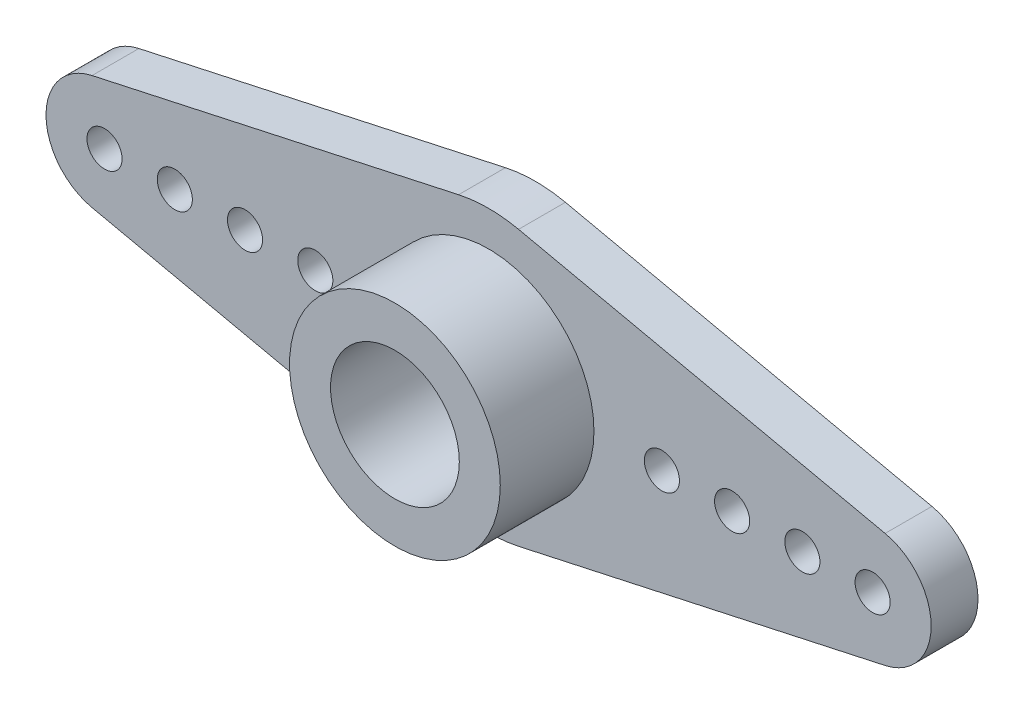
ISO-10303-21;
HEADER;
FILE_DESCRIPTION(('STEP AP214'),'2;1');
FILE_NAME('part.step','',(''),(''),'','','');
FILE_SCHEMA(('AUTOMOTIVE_DESIGN { 1 0 10303 214 1 1 1 1 }'));
ENDSEC;
DATA;
#1=APPLICATION_CONTEXT('core data for automotive mechanical design processes');
#2=APPLICATION_PROTOCOL_DEFINITION('international standard','automotive_design',2000,#1);
#3=PRODUCT_CONTEXT('',#1,'mechanical');
#4=PRODUCT('Part','Part','',(#3));
#5=PRODUCT_RELATED_PRODUCT_CATEGORY('part','',(#4));
#6=PRODUCT_DEFINITION_FORMATION('','',#4);
#7=PRODUCT_DEFINITION_CONTEXT('part definition',#1,'design');
#8=PRODUCT_DEFINITION('design','',#6,#7);
#9=PRODUCT_DEFINITION_SHAPE('','',#8);
#10=(LENGTH_UNIT() NAMED_UNIT(*) SI_UNIT(.MILLI.,.METRE.));
#11=(NAMED_UNIT(*) PLANE_ANGLE_UNIT() SI_UNIT($,.RADIAN.));
#12=(NAMED_UNIT(*) SI_UNIT($,.STERADIAN.) SOLID_ANGLE_UNIT());
#13=UNCERTAINTY_MEASURE_WITH_UNIT(LENGTH_MEASURE(1.E-05),#10,'distance_accuracy_value','');
#14=(GEOMETRIC_REPRESENTATION_CONTEXT(3) GLOBAL_UNCERTAINTY_ASSIGNED_CONTEXT((#13)) GLOBAL_UNIT_ASSIGNED_CONTEXT((#10,
#11,#12)) REPRESENTATION_CONTEXT('',''));
#15=CARTESIAN_POINT('',(0.,0.,0.));
#16=DIRECTION('',(0.,0.,1.));
#17=DIRECTION('',(1.,0.,0.));
#18=AXIS2_PLACEMENT_3D('',#15,#16,#17);
#19=CARTESIAN_POINT('',(-16.4,0.,2.));
#20=DIRECTION('',(0.,0.,1.));
#21=DIRECTION('',(1.,0.,0.));
#22=AXIS2_PLACEMENT_3D('',#19,#20,#21);
#23=PLANE('',#22);
#24=CARTESIAN_POINT('',(0.,0.,2.));
#25=DIRECTION('',(0.,0.,1.));
#26=DIRECTION('',(1.,0.,0.));
#27=AXIS2_PLACEMENT_3D('',#24,#25,#26);
#28=CIRCLE('',#27,1.5);
#29=CARTESIAN_POINT('',(1.5,0.,2.));
#30=VERTEX_POINT('',#29);
#31=EDGE_CURVE('E135',#30,#30,#28,.T.);
#32=ORIENTED_EDGE('',*,*,#31,.F.);
#33=EDGE_LOOP('',(#32));
#34=FACE_BOUND('',#33,.T.);
#35=CARTESIAN_POINT('',(0.,0.,2.));
#36=DIRECTION('',(0.,0.,1.));
#37=DIRECTION('',(1.,0.,0.));
#38=AXIS2_PLACEMENT_3D('',#35,#36,#37);
#39=CIRCLE('',#38,2.75);
#40=CARTESIAN_POINT('',(2.75,0.,2.));
#41=VERTEX_POINT('',#40);
#42=EDGE_CURVE('E11',#41,#41,#39,.F.);
#43=ORIENTED_EDGE('',*,*,#42,.F.);
#44=EDGE_LOOP('',(#43));
#45=FACE_BOUND('',#44,.T.);
#46=ADVANCED_FACE('F32',(#34,#45),#23,.T.);
#47=CARTESIAN_POINT('',(0.,0.,2.));
#48=DIRECTION('',(0.,0.,1.));
#49=DIRECTION('',(1.,0.,0.));
#50=AXIS2_PLACEMENT_3D('',#47,#48,#49);
#51=CIRCLE('',#50,4.5);
#52=CARTESIAN_POINT('',(4.5,0.,2.));
#53=VERTEX_POINT('',#52);
#54=EDGE_CURVE('E238',#53,#53,#51,.T.);
#55=ORIENTED_EDGE('',*,*,#54,.F.);
#56=EDGE_LOOP('',(#55));
#57=FACE_BOUND('',#56,.T.);
#58=CARTESIAN_POINT('',(-13.4,0.,2.));
#59=DIRECTION('',(0.,0.,1.));
#60=DIRECTION('',(1.,0.,0.));
#61=AXIS2_PLACEMENT_3D('',#58,#59,#60);
#62=CIRCLE('',#61,0.75);
#63=CARTESIAN_POINT('',(-12.65,0.,2.));
#64=VERTEX_POINT('',#63);
#65=EDGE_CURVE('E223',#64,#64,#62,.T.);
#66=ORIENTED_EDGE('',*,*,#65,.F.);
#67=EDGE_LOOP('',(#66));
#68=FACE_BOUND('',#67,.T.);
#69=CARTESIAN_POINT('',(-7.4,0.,2.));
#70=DIRECTION('',(0.,0.,1.));
#71=DIRECTION('',(1.,0.,0.));
#72=AXIS2_PLACEMENT_3D('',#69,#70,#71);
#73=CIRCLE('',#72,0.75);
#74=CARTESIAN_POINT('',(-6.65,0.,2.));
#75=VERTEX_POINT('',#74);
#76=EDGE_CURVE('E211',#75,#75,#73,.T.);
#77=ORIENTED_EDGE('',*,*,#76,.F.);
#78=EDGE_LOOP('',(#77));
#79=FACE_BOUND('',#78,.T.);
#80=CARTESIAN_POINT('',(13.4,0.,2.));
#81=DIRECTION('',(0.,0.,1.));
#82=DIRECTION('',(1.,0.,0.));
#83=AXIS2_PLACEMENT_3D('',#80,#81,#82);
#84=CIRCLE('',#83,0.75);
#85=CARTESIAN_POINT('',(14.15,0.,2.));
#86=VERTEX_POINT('',#85);
#87=EDGE_CURVE('E199',#86,#86,#84,.T.);
#88=ORIENTED_EDGE('',*,*,#87,.F.);
#89=EDGE_LOOP('',(#88));
#90=FACE_BOUND('',#89,.T.);
#91=CARTESIAN_POINT('',(7.4,0.,2.));
#92=DIRECTION('',(0.,0.,1.));
#93=DIRECTION('',(1.,0.,0.));
#94=AXIS2_PLACEMENT_3D('',#91,#92,#93);
#95=CIRCLE('',#94,0.749999999999998);
#96=CARTESIAN_POINT('',(8.15,0.,2.));
#97=VERTEX_POINT('',#96);
#98=EDGE_CURVE('E187',#97,#97,#95,.T.);
#99=ORIENTED_EDGE('',*,*,#98,.F.);
#100=EDGE_LOOP('',(#99));
#101=FACE_BOUND('',#100,.T.);
#102=CARTESIAN_POINT('',(-16.4,0.,2.));
#103=DIRECTION('',(0.,0.,1.));
#104=DIRECTION('',(1.,0.,0.));
#105=AXIS2_PLACEMENT_3D('',#102,#103,#104);
#106=CIRCLE('',#105,2.5);
#107=CARTESIAN_POINT('',(-16.9335365853659,2.44240428923554,2.));
#108=VERTEX_POINT('',#107);
#109=CARTESIAN_POINT('',(-16.9335365853659,-2.44240428923553,2.));
#110=VERTEX_POINT('',#109);
#111=EDGE_CURVE('E146',#108,#110,#106,.T.);
#112=ORIENTED_EDGE('',*,*,#111,.T.);
#113=DIRECTION('',(0.976961715694215,-0.213414634146342,0.));
#114=VECTOR('',#113,1.);
#115=CARTESIAN_POINT('',(-16.9335365853659,-2.44240428923553,2.));
#116=LINE('',#115,#114);
#117=CARTESIAN_POINT('',(-1.28048780487805,-5.86177029416529,2.));
#118=VERTEX_POINT('',#117);
#119=EDGE_CURVE('E93',#110,#118,#116,.T.);
#120=ORIENTED_EDGE('',*,*,#119,.T.);
#121=CARTESIAN_POINT('',(0.,0.,2.));
#122=DIRECTION('',(0.,0.,1.));
#123=DIRECTION('',(1.,0.,0.));
#124=AXIS2_PLACEMENT_3D('',#121,#122,#123);
#125=CIRCLE('',#124,6.);
#126=CARTESIAN_POINT('',(1.28048780487805,-5.86177029416529,2.));
#127=VERTEX_POINT('',#126);
#128=EDGE_CURVE('E178',#118,#127,#125,.T.);
#129=ORIENTED_EDGE('',*,*,#128,.T.);
#130=DIRECTION('',(0.976961715694215,0.213414634146342,0.));
#131=VECTOR('',#130,1.);
#132=CARTESIAN_POINT('',(16.9335365853659,-2.44240428923554,2.));
#133=LINE('',#132,#131);
#134=CARTESIAN_POINT('',(16.9335365853659,-2.44240428923554,2.));
#135=VERTEX_POINT('',#134);
#136=EDGE_CURVE('E177',#127,#135,#133,.T.);
#137=ORIENTED_EDGE('',*,*,#136,.T.);
#138=CARTESIAN_POINT('',(16.4,0.,2.));
#139=DIRECTION('',(0.,0.,1.));
#140=DIRECTION('',(1.,0.,0.));
#141=AXIS2_PLACEMENT_3D('',#138,#139,#140);
#142=CIRCLE('',#141,2.5);
#143=CARTESIAN_POINT('',(16.9335365853659,2.44240428923554,2.));
#144=VERTEX_POINT('',#143);
#145=EDGE_CURVE('E113',#135,#144,#142,.T.);
#146=ORIENTED_EDGE('',*,*,#145,.T.);
#147=DIRECTION('',(-0.976961715694215,0.213414634146342,0.));
#148=VECTOR('',#147,1.);
#149=CARTESIAN_POINT('',(16.9335365853659,2.44240428923554,2.));
#150=LINE('',#149,#148);
#151=CARTESIAN_POINT('',(1.28048780487805,5.86177029416529,2.));
#152=VERTEX_POINT('',#151);
#153=EDGE_CURVE('E106',#144,#152,#150,.T.);
#154=ORIENTED_EDGE('',*,*,#153,.T.);
#155=CARTESIAN_POINT('',(0.,0.,2.));
#156=DIRECTION('',(0.,0.,1.));
#157=DIRECTION('',(1.,0.,0.));
#158=AXIS2_PLACEMENT_3D('',#155,#156,#157);
#159=CIRCLE('',#158,6.);
#160=CARTESIAN_POINT('',(-1.28048780487805,5.86177029416529,2.));
#161=VERTEX_POINT('',#160);
#162=EDGE_CURVE('E111',#152,#161,#159,.T.);
#163=ORIENTED_EDGE('',*,*,#162,.T.);
#164=DIRECTION('',(-0.976961715694215,-0.213414634146342,0.));
#165=VECTOR('',#164,1.);
#166=CARTESIAN_POINT('',(-16.9335365853659,2.44240428923554,2.));
#167=LINE('',#166,#165);
#168=EDGE_CURVE('E49',#161,#108,#167,.T.);
#169=ORIENTED_EDGE('',*,*,#168,.T.);
#170=EDGE_LOOP('',(#112,#120,#129,#137,#146,#154,#163,#169));
#171=FACE_BOUND('',#170,.T.);
#172=CARTESIAN_POINT('',(10.4,0.,2.));
#173=DIRECTION('',(0.,0.,1.));
#174=DIRECTION('',(1.,0.,0.));
#175=AXIS2_PLACEMENT_3D('',#172,#173,#174);
#176=CIRCLE('',#175,0.75);
#177=CARTESIAN_POINT('',(11.15,0.,2.));
#178=VERTEX_POINT('',#177);
#179=EDGE_CURVE('E193',#178,#178,#176,.T.);
#180=ORIENTED_EDGE('',*,*,#179,.F.);
#181=EDGE_LOOP('',(#180));
#182=FACE_BOUND('',#181,.T.);
#183=CARTESIAN_POINT('',(16.4,0.,2.));
#184=DIRECTION('',(0.,0.,1.));
#185=DIRECTION('',(1.,0.,0.));
#186=AXIS2_PLACEMENT_3D('',#183,#184,#185);
#187=CIRCLE('',#186,0.750000000000002);
#188=CARTESIAN_POINT('',(17.15,0.,2.));
#189=VERTEX_POINT('',#188);
#190=EDGE_CURVE('E205',#189,#189,#187,.T.);
#191=ORIENTED_EDGE('',*,*,#190,.F.);
#192=EDGE_LOOP('',(#191));
#193=FACE_BOUND('',#192,.T.);
#194=CARTESIAN_POINT('',(-10.4,0.,2.));
#195=DIRECTION('',(0.,0.,1.));
#196=DIRECTION('',(1.,0.,0.));
#197=AXIS2_PLACEMENT_3D('',#194,#195,#196);
#198=CIRCLE('',#197,0.75);
#199=CARTESIAN_POINT('',(-9.65,0.,2.));
#200=VERTEX_POINT('',#199);
#201=EDGE_CURVE('E217',#200,#200,#198,.T.);
#202=ORIENTED_EDGE('',*,*,#201,.F.);
#203=EDGE_LOOP('',(#202));
#204=FACE_BOUND('',#203,.T.);
#205=CARTESIAN_POINT('',(-16.4,0.,2.));
#206=DIRECTION('',(0.,0.,1.));
#207=DIRECTION('',(1.,0.,0.));
#208=AXIS2_PLACEMENT_3D('',#205,#206,#207);
#209=CIRCLE('',#208,0.749999999999998);
#210=CARTESIAN_POINT('',(-15.65,0.,2.));
#211=VERTEX_POINT('',#210);
#212=EDGE_CURVE('E229',#211,#211,#209,.T.);
#213=ORIENTED_EDGE('',*,*,#212,.F.);
#214=EDGE_LOOP('',(#213));
#215=FACE_BOUND('',#214,.T.);
#216=ADVANCED_FACE('F108',(#57,#68,#79,#90,#101,#171,#182,#193,#204,#215),#23,.T.);
#217=CARTESIAN_POINT('',(-16.4,0.,0.));
#218=DIRECTION('',(0.,0.,1.));
#219=DIRECTION('',(1.,0.,0.));
#220=AXIS2_PLACEMENT_3D('',#217,#218,#219);
#221=PLANE('',#220);
#222=CARTESIAN_POINT('',(-16.4,0.,0.));
#223=DIRECTION('',(0.,0.,1.));
#224=DIRECTION('',(1.,0.,0.));
#225=AXIS2_PLACEMENT_3D('',#222,#223,#224);
#226=CIRCLE('',#225,2.5);
#227=CARTESIAN_POINT('',(-16.9335365853659,2.44240428923554,0.));
#228=VERTEX_POINT('',#227);
#229=CARTESIAN_POINT('',(-16.9335365853659,-2.44240428923553,0.));
#230=VERTEX_POINT('',#229);
#231=EDGE_CURVE('E131',#228,#230,#226,.T.);
#232=ORIENTED_EDGE('',*,*,#231,.F.);
#233=DIRECTION('',(-0.976961715694215,-0.213414634146342,0.));
#234=VECTOR('',#233,1.);
#235=CARTESIAN_POINT('',(-16.9335365853659,2.44240428923554,0.));
#236=LINE('',#235,#234);
#237=CARTESIAN_POINT('',(-1.28048780487805,5.86177029416529,0.));
#238=VERTEX_POINT('',#237);
#239=EDGE_CURVE('E84',#238,#228,#236,.T.);
#240=ORIENTED_EDGE('',*,*,#239,.F.);
#241=CARTESIAN_POINT('',(0.,0.,0.));
#242=DIRECTION('',(0.,0.,1.));
#243=DIRECTION('',(1.,0.,0.));
#244=AXIS2_PLACEMENT_3D('',#241,#242,#243);
#245=CIRCLE('',#244,6.);
#246=CARTESIAN_POINT('',(1.28048780487805,5.86177029416529,0.));
#247=VERTEX_POINT('',#246);
#248=EDGE_CURVE('E78',#247,#238,#245,.T.);
#249=ORIENTED_EDGE('',*,*,#248,.F.);
#250=DIRECTION('',(-0.976961715694215,0.213414634146342,0.));
#251=VECTOR('',#250,1.);
#252=CARTESIAN_POINT('',(16.9335365853659,2.44240428923554,0.));
#253=LINE('',#252,#251);
#254=CARTESIAN_POINT('',(16.9335365853659,2.44240428923554,0.));
#255=VERTEX_POINT('',#254);
#256=EDGE_CURVE('E121',#255,#247,#253,.T.);
#257=ORIENTED_EDGE('',*,*,#256,.F.);
#258=CARTESIAN_POINT('',(16.4,0.,0.));
#259=DIRECTION('',(0.,0.,1.));
#260=DIRECTION('',(1.,0.,0.));
#261=AXIS2_PLACEMENT_3D('',#258,#259,#260);
#262=CIRCLE('',#261,2.5);
#263=CARTESIAN_POINT('',(16.9335365853659,-2.44240428923554,0.));
#264=VERTEX_POINT('',#263);
#265=EDGE_CURVE('E141',#264,#255,#262,.T.);
#266=ORIENTED_EDGE('',*,*,#265,.F.);
#267=DIRECTION('',(0.976961715694215,0.213414634146342,0.));
#268=VECTOR('',#267,1.);
#269=CARTESIAN_POINT('',(16.9335365853659,-2.44240428923554,0.));
#270=LINE('',#269,#268);
#271=CARTESIAN_POINT('',(1.28048780487805,-5.86177029416529,0.));
#272=VERTEX_POINT('',#271);
#273=EDGE_CURVE('E139',#272,#264,#270,.T.);
#274=ORIENTED_EDGE('',*,*,#273,.F.);
#275=CARTESIAN_POINT('',(0.,0.,0.));
#276=DIRECTION('',(0.,0.,1.));
#277=DIRECTION('',(1.,0.,0.));
#278=AXIS2_PLACEMENT_3D('',#275,#276,#277);
#279=CIRCLE('',#278,6.);
#280=CARTESIAN_POINT('',(-1.28048780487805,-5.86177029416529,0.));
#281=VERTEX_POINT('',#280);
#282=EDGE_CURVE('E137',#281,#272,#279,.T.);
#283=ORIENTED_EDGE('',*,*,#282,.F.);
#284=DIRECTION('',(0.976961715694215,-0.213414634146342,0.));
#285=VECTOR('',#284,1.);
#286=CARTESIAN_POINT('',(-16.9335365853659,-2.44240428923553,0.));
#287=LINE('',#286,#285);
#288=EDGE_CURVE('E134',#230,#281,#287,.T.);
#289=ORIENTED_EDGE('',*,*,#288,.F.);
#290=EDGE_LOOP('',(#232,#240,#249,#257,#266,#274,#283,#289));
#291=FACE_BOUND('',#290,.T.);
#292=CARTESIAN_POINT('',(0.,0.,0.));
#293=DIRECTION('',(0.,0.,1.));
#294=DIRECTION('',(1.,0.,0.));
#295=AXIS2_PLACEMENT_3D('',#292,#293,#294);
#296=CIRCLE('',#295,1.5);
#297=CARTESIAN_POINT('',(1.5,0.,0.));
#298=VERTEX_POINT('',#297);
#299=EDGE_CURVE('E184',#298,#298,#296,.T.);
#300=ORIENTED_EDGE('',*,*,#299,.T.);
#301=EDGE_LOOP('',(#300));
#302=FACE_BOUND('',#301,.T.);
#303=CARTESIAN_POINT('',(7.4,0.,0.));
#304=DIRECTION('',(0.,0.,1.));
#305=DIRECTION('',(1.,0.,0.));
#306=AXIS2_PLACEMENT_3D('',#303,#304,#305);
#307=CIRCLE('',#306,0.749999999999998);
#308=CARTESIAN_POINT('',(8.15,0.,0.));
#309=VERTEX_POINT('',#308);
#310=EDGE_CURVE('E190',#309,#309,#307,.T.);
#311=ORIENTED_EDGE('',*,*,#310,.T.);
#312=EDGE_LOOP('',(#311));
#313=FACE_BOUND('',#312,.T.);
#314=CARTESIAN_POINT('',(10.4,0.,0.));
#315=DIRECTION('',(0.,0.,1.));
#316=DIRECTION('',(1.,0.,0.));
#317=AXIS2_PLACEMENT_3D('',#314,#315,#316);
#318=CIRCLE('',#317,0.75);
#319=CARTESIAN_POINT('',(11.15,0.,0.));
#320=VERTEX_POINT('',#319);
#321=EDGE_CURVE('E196',#320,#320,#318,.T.);
#322=ORIENTED_EDGE('',*,*,#321,.T.);
#323=EDGE_LOOP('',(#322));
#324=FACE_BOUND('',#323,.T.);
#325=CARTESIAN_POINT('',(13.4,0.,0.));
#326=DIRECTION('',(0.,0.,1.));
#327=DIRECTION('',(1.,0.,0.));
#328=AXIS2_PLACEMENT_3D('',#325,#326,#327);
#329=CIRCLE('',#328,0.75);
#330=CARTESIAN_POINT('',(14.15,0.,0.));
#331=VERTEX_POINT('',#330);
#332=EDGE_CURVE('E202',#331,#331,#329,.T.);
#333=ORIENTED_EDGE('',*,*,#332,.T.);
#334=EDGE_LOOP('',(#333));
#335=FACE_BOUND('',#334,.T.);
#336=CARTESIAN_POINT('',(16.4,0.,0.));
#337=DIRECTION('',(0.,0.,1.));
#338=DIRECTION('',(1.,0.,0.));
#339=AXIS2_PLACEMENT_3D('',#336,#337,#338);
#340=CIRCLE('',#339,0.750000000000002);
#341=CARTESIAN_POINT('',(17.15,0.,0.));
#342=VERTEX_POINT('',#341);
#343=EDGE_CURVE('E208',#342,#342,#340,.T.);
#344=ORIENTED_EDGE('',*,*,#343,.T.);
#345=EDGE_LOOP('',(#344));
#346=FACE_BOUND('',#345,.T.);
#347=CARTESIAN_POINT('',(-7.4,0.,0.));
#348=DIRECTION('',(0.,0.,1.));
#349=DIRECTION('',(1.,0.,0.));
#350=AXIS2_PLACEMENT_3D('',#347,#348,#349);
#351=CIRCLE('',#350,0.75);
#352=CARTESIAN_POINT('',(-6.65,0.,0.));
#353=VERTEX_POINT('',#352);
#354=EDGE_CURVE('E214',#353,#353,#351,.T.);
#355=ORIENTED_EDGE('',*,*,#354,.T.);
#356=EDGE_LOOP('',(#355));
#357=FACE_BOUND('',#356,.T.);
#358=CARTESIAN_POINT('',(-10.4,0.,0.));
#359=DIRECTION('',(0.,0.,1.));
#360=DIRECTION('',(1.,0.,0.));
#361=AXIS2_PLACEMENT_3D('',#358,#359,#360);
#362=CIRCLE('',#361,0.75);
#363=CARTESIAN_POINT('',(-9.65,0.,0.));
#364=VERTEX_POINT('',#363);
#365=EDGE_CURVE('E220',#364,#364,#362,.T.);
#366=ORIENTED_EDGE('',*,*,#365,.T.);
#367=EDGE_LOOP('',(#366));
#368=FACE_BOUND('',#367,.T.);
#369=CARTESIAN_POINT('',(-13.4,0.,0.));
#370=DIRECTION('',(0.,0.,1.));
#371=DIRECTION('',(1.,0.,0.));
#372=AXIS2_PLACEMENT_3D('',#369,#370,#371);
#373=CIRCLE('',#372,0.75);
#374=CARTESIAN_POINT('',(-12.65,0.,0.));
#375=VERTEX_POINT('',#374);
#376=EDGE_CURVE('E226',#375,#375,#373,.T.);
#377=ORIENTED_EDGE('',*,*,#376,.T.);
#378=EDGE_LOOP('',(#377));
#379=FACE_BOUND('',#378,.T.);
#380=CARTESIAN_POINT('',(-16.4,0.,0.));
#381=DIRECTION('',(0.,0.,1.));
#382=DIRECTION('',(1.,0.,0.));
#383=AXIS2_PLACEMENT_3D('',#380,#381,#382);
#384=CIRCLE('',#383,0.749999999999998);
#385=CARTESIAN_POINT('',(-15.65,0.,0.));
#386=VERTEX_POINT('',#385);
#387=EDGE_CURVE('E232',#386,#386,#384,.T.);
#388=ORIENTED_EDGE('',*,*,#387,.T.);
#389=EDGE_LOOP('',(#388));
#390=FACE_BOUND('',#389,.T.);
#391=ADVANCED_FACE('F164',(#291,#302,#313,#324,#335,#346,#357,#368,#379,#390),#221,.F.);
#392=CARTESIAN_POINT('',(-16.4,0.,2.));
#393=DIRECTION('',(0.,0.,-1.));
#394=DIRECTION('',(-1.,0.,0.));
#395=AXIS2_PLACEMENT_3D('',#392,#393,#394);
#396=CYLINDRICAL_SURFACE('',#395,2.5);
#397=ORIENTED_EDGE('',*,*,#231,.T.);
#398=DIRECTION('',(0.,0.,-1.));
#399=VECTOR('',#398,1.);
#400=CARTESIAN_POINT('',(-16.9335365853659,-2.44240428923553,2.));
#401=LINE('',#400,#399);
#402=EDGE_CURVE('E41',#110,#230,#401,.T.);
#403=ORIENTED_EDGE('',*,*,#402,.F.);
#404=ORIENTED_EDGE('',*,*,#111,.F.);
#405=DIRECTION('',(0.,0.,-1.));
#406=VECTOR('',#405,1.);
#407=CARTESIAN_POINT('',(-16.9335365853659,2.44240428923554,2.));
#408=LINE('',#407,#406);
#409=EDGE_CURVE('E127',#108,#228,#408,.T.);
#410=ORIENTED_EDGE('',*,*,#409,.T.);
#411=EDGE_LOOP('',(#397,#403,#404,#410));
#412=FACE_BOUND('',#411,.T.);
#413=ADVANCED_FACE('F34',(#412),#396,.T.);
#414=CARTESIAN_POINT('',(-16.9335365853659,-2.44240428923553,2.));
#415=DIRECTION('',(0.213414634146342,0.976961715694215,0.));
#416=DIRECTION('',(-0.976961715694215,0.213414634146342,0.));
#417=AXIS2_PLACEMENT_3D('',#414,#415,#416);
#418=PLANE('',#417);
#419=ORIENTED_EDGE('',*,*,#288,.T.);
#420=DIRECTION('',(0.,0.,-1.));
#421=VECTOR('',#420,1.);
#422=CARTESIAN_POINT('',(-1.28048780487805,-5.86177029416529,2.));
#423=LINE('',#422,#421);
#424=EDGE_CURVE('E156',#118,#281,#423,.T.);
#425=ORIENTED_EDGE('',*,*,#424,.F.);
#426=ORIENTED_EDGE('',*,*,#119,.F.);
#427=ORIENTED_EDGE('',*,*,#402,.T.);
#428=EDGE_LOOP('',(#419,#425,#426,#427));
#429=FACE_BOUND('',#428,.T.);
#430=ADVANCED_FACE('F159',(#429),#418,.F.);
#431=CARTESIAN_POINT('',(0.,0.,2.));
#432=DIRECTION('',(0.,0.,-1.));
#433=DIRECTION('',(-1.,0.,0.));
#434=AXIS2_PLACEMENT_3D('',#431,#432,#433);
#435=CYLINDRICAL_SURFACE('',#434,6.);
#436=ORIENTED_EDGE('',*,*,#282,.T.);
#437=DIRECTION('',(0.,0.,-1.));
#438=VECTOR('',#437,1.);
#439=CARTESIAN_POINT('',(1.28048780487805,-5.86177029416529,2.));
#440=LINE('',#439,#438);
#441=EDGE_CURVE('E153',#127,#272,#440,.T.);
#442=ORIENTED_EDGE('',*,*,#441,.F.);
#443=ORIENTED_EDGE('',*,*,#128,.F.);
#444=ORIENTED_EDGE('',*,*,#424,.T.);
#445=EDGE_LOOP('',(#436,#442,#443,#444));
#446=FACE_BOUND('',#445,.T.);
#447=ADVANCED_FACE('F171',(#446),#435,.T.);
#448=CARTESIAN_POINT('',(16.9335365853659,-2.44240428923554,2.));
#449=DIRECTION('',(-0.213414634146342,0.976961715694215,0.));
#450=DIRECTION('',(-0.976961715694215,-0.213414634146342,0.));
#451=AXIS2_PLACEMENT_3D('',#448,#449,#450);
#452=PLANE('',#451);
#453=ORIENTED_EDGE('',*,*,#273,.T.);
#454=DIRECTION('',(0.,0.,-1.));
#455=VECTOR('',#454,1.);
#456=CARTESIAN_POINT('',(16.9335365853659,-2.44240428923554,2.));
#457=LINE('',#456,#455);
#458=EDGE_CURVE('E150',#135,#264,#457,.T.);
#459=ORIENTED_EDGE('',*,*,#458,.F.);
#460=ORIENTED_EDGE('',*,*,#136,.F.);
#461=ORIENTED_EDGE('',*,*,#441,.T.);
#462=EDGE_LOOP('',(#453,#459,#460,#461));
#463=FACE_BOUND('',#462,.T.);
#464=ADVANCED_FACE('F175',(#463),#452,.F.);
#465=CARTESIAN_POINT('',(16.4,0.,2.));
#466=DIRECTION('',(0.,0.,-1.));
#467=DIRECTION('',(-1.,0.,0.));
#468=AXIS2_PLACEMENT_3D('',#465,#466,#467);
#469=CYLINDRICAL_SURFACE('',#468,2.5);
#470=ORIENTED_EDGE('',*,*,#265,.T.);
#471=DIRECTION('',(0.,0.,-1.));
#472=VECTOR('',#471,1.);
#473=CARTESIAN_POINT('',(16.9335365853659,2.44240428923554,2.));
#474=LINE('',#473,#472);
#475=EDGE_CURVE('E122',#144,#255,#474,.T.);
#476=ORIENTED_EDGE('',*,*,#475,.F.);
#477=ORIENTED_EDGE('',*,*,#145,.F.);
#478=ORIENTED_EDGE('',*,*,#458,.T.);
#479=EDGE_LOOP('',(#470,#476,#477,#478));
#480=FACE_BOUND('',#479,.T.);
#481=ADVANCED_FACE('F288',(#480),#469,.T.);
#482=CARTESIAN_POINT('',(16.9335365853659,2.44240428923554,2.));
#483=DIRECTION('',(-0.213414634146342,-0.976961715694215,0.));
#484=DIRECTION('',(0.976961715694215,-0.213414634146342,0.));
#485=AXIS2_PLACEMENT_3D('',#482,#483,#484);
#486=PLANE('',#485);
#487=ORIENTED_EDGE('',*,*,#256,.T.);
#488=DIRECTION('',(0.,0.,-1.));
#489=VECTOR('',#488,1.);
#490=CARTESIAN_POINT('',(1.28048780487805,5.86177029416529,2.));
#491=LINE('',#490,#489);
#492=EDGE_CURVE('E118',#152,#247,#491,.T.);
#493=ORIENTED_EDGE('',*,*,#492,.F.);
#494=ORIENTED_EDGE('',*,*,#153,.F.);
#495=ORIENTED_EDGE('',*,*,#475,.T.);
#496=EDGE_LOOP('',(#487,#493,#494,#495));
#497=FACE_BOUND('',#496,.T.);
#498=ADVANCED_FACE('F119',(#497),#486,.F.);
#499=CARTESIAN_POINT('',(0.,0.,2.));
#500=DIRECTION('',(0.,0.,-1.));
#501=DIRECTION('',(-1.,0.,0.));
#502=AXIS2_PLACEMENT_3D('',#499,#500,#501);
#503=CYLINDRICAL_SURFACE('',#502,6.);
#504=ORIENTED_EDGE('',*,*,#248,.T.);
#505=DIRECTION('',(0.,0.,-1.));
#506=VECTOR('',#505,1.);
#507=CARTESIAN_POINT('',(-1.28048780487805,5.86177029416529,2.));
#508=LINE('',#507,#506);
#509=EDGE_CURVE('E123',#161,#238,#508,.T.);
#510=ORIENTED_EDGE('',*,*,#509,.F.);
#511=ORIENTED_EDGE('',*,*,#162,.F.);
#512=ORIENTED_EDGE('',*,*,#492,.T.);
#513=EDGE_LOOP('',(#504,#510,#511,#512));
#514=FACE_BOUND('',#513,.T.);
#515=ADVANCED_FACE('F125',(#514),#503,.T.);
#516=CARTESIAN_POINT('',(-16.9335365853659,2.44240428923554,2.));
#517=DIRECTION('',(0.213414634146342,-0.976961715694215,0.));
#518=DIRECTION('',(0.976961715694215,0.213414634146342,0.));
#519=AXIS2_PLACEMENT_3D('',#516,#517,#518);
#520=PLANE('',#519);
#521=ORIENTED_EDGE('',*,*,#239,.T.);
#522=ORIENTED_EDGE('',*,*,#409,.F.);
#523=ORIENTED_EDGE('',*,*,#168,.F.);
#524=ORIENTED_EDGE('',*,*,#509,.T.);
#525=EDGE_LOOP('',(#521,#522,#523,#524));
#526=FACE_BOUND('',#525,.T.);
#527=ADVANCED_FACE('F281',(#526),#520,.F.);
#528=CARTESIAN_POINT('',(0.,0.,2.));
#529=DIRECTION('',(0.,0.,-1.));
#530=DIRECTION('',(-1.,0.,0.));
#531=AXIS2_PLACEMENT_3D('',#528,#529,#530);
#532=CYLINDRICAL_SURFACE('',#531,1.5);
#533=ORIENTED_EDGE('',*,*,#31,.T.);
#534=EDGE_LOOP('',(#533));
#535=FACE_BOUND('',#534,.T.);
#536=ORIENTED_EDGE('',*,*,#299,.F.);
#537=EDGE_LOOP('',(#536));
#538=FACE_BOUND('',#537,.T.);
#539=ADVANCED_FACE('F277',(#535,#538),#532,.F.);
#540=CARTESIAN_POINT('',(7.4,0.,2.));
#541=DIRECTION('',(0.,0.,-1.));
#542=DIRECTION('',(-1.,0.,0.));
#543=AXIS2_PLACEMENT_3D('',#540,#541,#542);
#544=CYLINDRICAL_SURFACE('',#543,0.749999999999998);
#545=ORIENTED_EDGE('',*,*,#98,.T.);
#546=EDGE_LOOP('',(#545));
#547=FACE_BOUND('',#546,.T.);
#548=ORIENTED_EDGE('',*,*,#310,.F.);
#549=EDGE_LOOP('',(#548));
#550=FACE_BOUND('',#549,.T.);
#551=ADVANCED_FACE('F390',(#547,#550),#544,.F.);
#552=CARTESIAN_POINT('',(10.4,0.,2.));
#553=DIRECTION('',(0.,0.,-1.));
#554=DIRECTION('',(-1.,0.,0.));
#555=AXIS2_PLACEMENT_3D('',#552,#553,#554);
#556=CYLINDRICAL_SURFACE('',#555,0.75);
#557=ORIENTED_EDGE('',*,*,#179,.T.);
#558=EDGE_LOOP('',(#557));
#559=FACE_BOUND('',#558,.T.);
#560=ORIENTED_EDGE('',*,*,#321,.F.);
#561=EDGE_LOOP('',(#560));
#562=FACE_BOUND('',#561,.T.);
#563=ADVANCED_FACE('F381',(#559,#562),#556,.F.);
#564=CARTESIAN_POINT('',(13.4,0.,2.));
#565=DIRECTION('',(0.,0.,-1.));
#566=DIRECTION('',(-1.,0.,0.));
#567=AXIS2_PLACEMENT_3D('',#564,#565,#566);
#568=CYLINDRICAL_SURFACE('',#567,0.75);
#569=ORIENTED_EDGE('',*,*,#87,.T.);
#570=EDGE_LOOP('',(#569));
#571=FACE_BOUND('',#570,.T.);
#572=ORIENTED_EDGE('',*,*,#332,.F.);
#573=EDGE_LOOP('',(#572));
#574=FACE_BOUND('',#573,.T.);
#575=ADVANCED_FACE('F372',(#571,#574),#568,.F.);
#576=CARTESIAN_POINT('',(16.4,0.,2.));
#577=DIRECTION('',(0.,0.,-1.));
#578=DIRECTION('',(-1.,0.,0.));
#579=AXIS2_PLACEMENT_3D('',#576,#577,#578);
#580=CYLINDRICAL_SURFACE('',#579,0.750000000000002);
#581=ORIENTED_EDGE('',*,*,#190,.T.);
#582=EDGE_LOOP('',(#581));
#583=FACE_BOUND('',#582,.T.);
#584=ORIENTED_EDGE('',*,*,#343,.F.);
#585=EDGE_LOOP('',(#584));
#586=FACE_BOUND('',#585,.T.);
#587=ADVANCED_FACE('F363',(#583,#586),#580,.F.);
#588=CARTESIAN_POINT('',(-7.4,0.,2.));
#589=DIRECTION('',(0.,0.,-1.));
#590=DIRECTION('',(-1.,0.,0.));
#591=AXIS2_PLACEMENT_3D('',#588,#589,#590);
#592=CYLINDRICAL_SURFACE('',#591,0.75);
#593=ORIENTED_EDGE('',*,*,#76,.T.);
#594=EDGE_LOOP('',(#593));
#595=FACE_BOUND('',#594,.T.);
#596=ORIENTED_EDGE('',*,*,#354,.F.);
#597=EDGE_LOOP('',(#596));
#598=FACE_BOUND('',#597,.T.);
#599=ADVANCED_FACE('F354',(#595,#598),#592,.F.);
#600=CARTESIAN_POINT('',(-10.4,0.,2.));
#601=DIRECTION('',(0.,0.,-1.));
#602=DIRECTION('',(-1.,0.,0.));
#603=AXIS2_PLACEMENT_3D('',#600,#601,#602);
#604=CYLINDRICAL_SURFACE('',#603,0.75);
#605=ORIENTED_EDGE('',*,*,#201,.T.);
#606=EDGE_LOOP('',(#605));
#607=FACE_BOUND('',#606,.T.);
#608=ORIENTED_EDGE('',*,*,#365,.F.);
#609=EDGE_LOOP('',(#608));
#610=FACE_BOUND('',#609,.T.);
#611=ADVANCED_FACE('F345',(#607,#610),#604,.F.);
#612=CARTESIAN_POINT('',(-13.4,0.,2.));
#613=DIRECTION('',(0.,0.,-1.));
#614=DIRECTION('',(-1.,0.,0.));
#615=AXIS2_PLACEMENT_3D('',#612,#613,#614);
#616=CYLINDRICAL_SURFACE('',#615,0.75);
#617=ORIENTED_EDGE('',*,*,#65,.T.);
#618=EDGE_LOOP('',(#617));
#619=FACE_BOUND('',#618,.T.);
#620=ORIENTED_EDGE('',*,*,#376,.F.);
#621=EDGE_LOOP('',(#620));
#622=FACE_BOUND('',#621,.T.);
#623=ADVANCED_FACE('F262',(#619,#622),#616,.F.);
#624=CARTESIAN_POINT('',(-16.4,0.,2.));
#625=DIRECTION('',(0.,0.,-1.));
#626=DIRECTION('',(-1.,0.,0.));
#627=AXIS2_PLACEMENT_3D('',#624,#625,#626);
#628=CYLINDRICAL_SURFACE('',#627,0.749999999999998);
#629=ORIENTED_EDGE('',*,*,#212,.T.);
#630=EDGE_LOOP('',(#629));
#631=FACE_BOUND('',#630,.T.);
#632=ORIENTED_EDGE('',*,*,#387,.F.);
#633=EDGE_LOOP('',(#632));
#634=FACE_BOUND('',#633,.T.);
#635=ADVANCED_FACE('F253',(#631,#634),#628,.F.);
#636=CARTESIAN_POINT('',(0.,0.,6.));
#637=DIRECTION('',(0.,0.,1.));
#638=DIRECTION('',(1.,0.,0.));
#639=AXIS2_PLACEMENT_3D('',#636,#637,#638);
#640=PLANE('',#639);
#641=CARTESIAN_POINT('',(0.,0.,6.));
#642=DIRECTION('',(0.,0.,1.));
#643=DIRECTION('',(1.,0.,0.));
#644=AXIS2_PLACEMENT_3D('',#641,#642,#643);
#645=CIRCLE('',#644,4.5);
#646=CARTESIAN_POINT('',(4.5,0.,6.));
#647=VERTEX_POINT('',#646);
#648=EDGE_CURVE('E235',#647,#647,#645,.T.);
#649=ORIENTED_EDGE('',*,*,#648,.T.);
#650=EDGE_LOOP('',(#649));
#651=FACE_BOUND('',#650,.T.);
#652=CARTESIAN_POINT('',(0.,0.,6.));
#653=DIRECTION('',(0.,0.,1.));
#654=DIRECTION('',(1.,0.,0.));
#655=AXIS2_PLACEMENT_3D('',#652,#653,#654);
#656=CIRCLE('',#655,2.75);
#657=CARTESIAN_POINT('',(2.75,0.,6.));
#658=VERTEX_POINT('',#657);
#659=EDGE_CURVE('E241',#658,#658,#656,.T.);
#660=ORIENTED_EDGE('',*,*,#659,.F.);
#661=EDGE_LOOP('',(#660));
#662=FACE_BOUND('',#661,.T.);
#663=ADVANCED_FACE('F250',(#651,#662),#640,.T.);
#664=CARTESIAN_POINT('',(0.,0.,6.));
#665=DIRECTION('',(0.,0.,-1.));
#666=DIRECTION('',(-1.,0.,0.));
#667=AXIS2_PLACEMENT_3D('',#664,#665,#666);
#668=CYLINDRICAL_SURFACE('',#667,4.5);
#669=ORIENTED_EDGE('',*,*,#648,.F.);
#670=EDGE_LOOP('',(#669));
#671=FACE_BOUND('',#670,.T.);
#672=ORIENTED_EDGE('',*,*,#54,.T.);
#673=EDGE_LOOP('',(#672));
#674=FACE_BOUND('',#673,.T.);
#675=ADVANCED_FACE('F252',(#671,#674),#668,.T.);
#676=CARTESIAN_POINT('',(0.,0.,6.));
#677=DIRECTION('',(0.,0.,-1.));
#678=DIRECTION('',(-1.,0.,0.));
#679=AXIS2_PLACEMENT_3D('',#676,#677,#678);
#680=CYLINDRICAL_SURFACE('',#679,2.75);
#681=ORIENTED_EDGE('',*,*,#659,.T.);
#682=EDGE_LOOP('',(#681));
#683=FACE_BOUND('',#682,.T.);
#684=ORIENTED_EDGE('',*,*,#42,.T.);
#685=EDGE_LOOP('',(#684));
#686=FACE_BOUND('',#685,.T.);
#687=ADVANCED_FACE('F247',(#683,#686),#680,.F.);
#688=CLOSED_SHELL('',(#46,#216,#391,#413,#430,#447,#464,#481,#498,#515,#527,#539,#551,#563,#575,
#587,#599,#611,#623,#635,#663,#675,#687));
#689=MANIFOLD_SOLID_BREP('B2',#688);
#690=ADVANCED_BREP_SHAPE_REPRESENTATION('',(#18,#689),#14);
#691=SHAPE_DEFINITION_REPRESENTATION(#9,#690);
ENDSEC;
END-ISO-10303-21;
